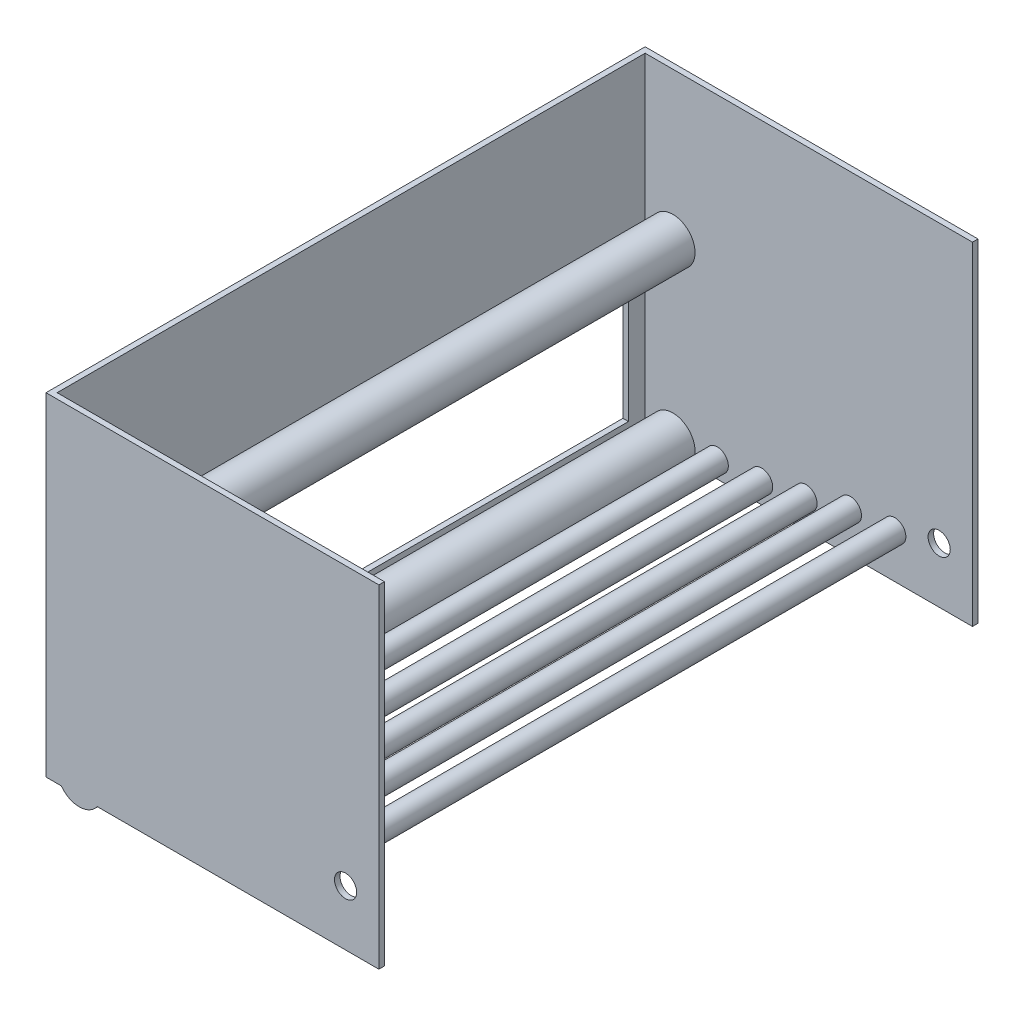
ISO-10303-21;
HEADER;
FILE_DESCRIPTION(('STEP AP214'),'2;1');
FILE_NAME('part.step','',(''),(''),'','','');
FILE_SCHEMA(('AUTOMOTIVE_DESIGN { 1 0 10303 214 1 1 1 1 }'));
ENDSEC;
DATA;
#1=APPLICATION_CONTEXT('core data for automotive mechanical design processes');
#2=APPLICATION_PROTOCOL_DEFINITION('international standard','automotive_design',2000,#1);
#3=PRODUCT_CONTEXT('',#1,'mechanical');
#4=PRODUCT('Part','Part','',(#3));
#5=PRODUCT_RELATED_PRODUCT_CATEGORY('part','',(#4));
#6=PRODUCT_DEFINITION_FORMATION('','',#4);
#7=PRODUCT_DEFINITION_CONTEXT('part definition',#1,'design');
#8=PRODUCT_DEFINITION('design','',#6,#7);
#9=PRODUCT_DEFINITION_SHAPE('','',#8);
#10=(LENGTH_UNIT() NAMED_UNIT(*) SI_UNIT(.MILLI.,.METRE.));
#11=(NAMED_UNIT(*) PLANE_ANGLE_UNIT() SI_UNIT($,.RADIAN.));
#12=(NAMED_UNIT(*) SI_UNIT($,.STERADIAN.) SOLID_ANGLE_UNIT());
#13=UNCERTAINTY_MEASURE_WITH_UNIT(LENGTH_MEASURE(1.E-05),#10,'distance_accuracy_value','');
#14=(GEOMETRIC_REPRESENTATION_CONTEXT(3) GLOBAL_UNCERTAINTY_ASSIGNED_CONTEXT((#13)) GLOBAL_UNIT_ASSIGNED_CONTEXT((#10,
#11,#12)) REPRESENTATION_CONTEXT('',''));
#15=CARTESIAN_POINT('',(0.,0.,0.));
#16=DIRECTION('',(0.,0.,1.));
#17=DIRECTION('',(1.,0.,0.));
#18=AXIS2_PLACEMENT_3D('',#15,#16,#17);
#19=CARTESIAN_POINT('',(0.,0.,0.));
#20=DIRECTION('',(0.,-1.,0.));
#21=DIRECTION('',(0.,0.,-1.));
#22=AXIS2_PLACEMENT_3D('',#19,#20,#21);
#23=PLANE('',#22);
#24=DIRECTION('',(0.,0.,1.));
#25=VECTOR('',#24,1.);
#26=CARTESIAN_POINT('',(58.6724220951825,0.,-751.292048968553));
#27=LINE('',#26,#25);
#28=CARTESIAN_POINT('',(58.6724220951825,0.,-6.34999999999997));
#29=VERTEX_POINT('',#28);
#30=CARTESIAN_POINT('',(58.6724220951825,0.,0.));
#31=VERTEX_POINT('',#30);
#32=EDGE_CURVE('E220',#29,#31,#27,.T.);
#33=ORIENTED_EDGE('',*,*,#32,.F.);
#34=DIRECTION('',(1.,0.,0.));
#35=VECTOR('',#34,1.);
#36=CARTESIAN_POINT('',(0.,0.,-6.35));
#37=LINE('',#36,#35);
#38=CARTESIAN_POINT('',(381.,0.,-6.35));
#39=VERTEX_POINT('',#38);
#40=EDGE_CURVE('E279',#29,#39,#37,.T.);
#41=ORIENTED_EDGE('',*,*,#40,.T.);
#42=DIRECTION('',(0.,0.,-1.));
#43=VECTOR('',#42,1.);
#44=CARTESIAN_POINT('',(381.,0.,0.));
#45=LINE('',#44,#43);
#46=CARTESIAN_POINT('',(381.,0.,0.));
#47=VERTEX_POINT('',#46);
#48=EDGE_CURVE('E330',#47,#39,#45,.T.);
#49=ORIENTED_EDGE('',*,*,#48,.F.);
#50=DIRECTION('',(1.,0.,0.));
#51=VECTOR('',#50,1.);
#52=CARTESIAN_POINT('',(0.,0.,0.));
#53=LINE('',#52,#51);
#54=EDGE_CURVE('E324',#31,#47,#53,.T.);
#55=ORIENTED_EDGE('',*,*,#54,.F.);
#56=EDGE_LOOP('',(#33,#41,#49,#55));
#57=FACE_BOUND('',#56,.T.);
#58=ADVANCED_FACE('F49',(#57),#23,.T.);
#59=CARTESIAN_POINT('',(381.,381.,0.));
#60=DIRECTION('',(-1.,0.,0.));
#61=DIRECTION('',(0.,0.,1.));
#62=AXIS2_PLACEMENT_3D('',#59,#60,#61);
#63=PLANE('',#62);
#64=DIRECTION('',(0.,-1.,0.));
#65=VECTOR('',#64,1.);
#66=CARTESIAN_POINT('',(381.,381.,-6.35));
#67=LINE('',#66,#65);
#68=CARTESIAN_POINT('',(381.,381.,-6.35));
#69=VERTEX_POINT('',#68);
#70=EDGE_CURVE('E269',#69,#39,#67,.T.);
#71=ORIENTED_EDGE('',*,*,#70,.F.);
#72=DIRECTION('',(0.,0.,-1.));
#73=VECTOR('',#72,1.);
#74=CARTESIAN_POINT('',(381.,381.,0.));
#75=LINE('',#74,#73);
#76=CARTESIAN_POINT('',(381.,381.,0.));
#77=VERTEX_POINT('',#76);
#78=EDGE_CURVE('E313',#77,#69,#75,.T.);
#79=ORIENTED_EDGE('',*,*,#78,.F.);
#80=DIRECTION('',(0.,-1.,0.));
#81=VECTOR('',#80,1.);
#82=CARTESIAN_POINT('',(381.,381.,0.));
#83=LINE('',#82,#81);
#84=EDGE_CURVE('E343',#77,#47,#83,.T.);
#85=ORIENTED_EDGE('',*,*,#84,.T.);
#86=ORIENTED_EDGE('',*,*,#48,.T.);
#87=EDGE_LOOP('',(#71,#79,#85,#86));
#88=FACE_BOUND('',#87,.T.);
#89=ADVANCED_FACE('F446',(#88),#63,.F.);
#90=CARTESIAN_POINT('',(0.,381.,0.));
#91=DIRECTION('',(0.,-1.,0.));
#92=DIRECTION('',(0.,0.,-1.));
#93=AXIS2_PLACEMENT_3D('',#90,#91,#92);
#94=PLANE('',#93);
#95=DIRECTION('',(1.,0.,0.));
#96=VECTOR('',#95,1.);
#97=CARTESIAN_POINT('',(0.,381.,-6.35));
#98=LINE('',#97,#96);
#99=CARTESIAN_POINT('',(6.35,381.,-6.35));
#100=VERTEX_POINT('',#99);
#101=EDGE_CURVE('E292',#100,#69,#98,.T.);
#102=ORIENTED_EDGE('',*,*,#101,.F.);
#103=DIRECTION('',(0.,0.,1.));
#104=VECTOR('',#103,1.);
#105=CARTESIAN_POINT('',(6.35,381.,0.));
#106=LINE('',#105,#104);
#107=CARTESIAN_POINT('',(6.35,381.,-679.45));
#108=VERTEX_POINT('',#107);
#109=EDGE_CURVE('E284',#108,#100,#106,.T.);
#110=ORIENTED_EDGE('',*,*,#109,.F.);
#111=DIRECTION('',(-1.,0.,0.));
#112=VECTOR('',#111,1.);
#113=CARTESIAN_POINT('',(0.,381.,-679.45));
#114=LINE('',#113,#112);
#115=CARTESIAN_POINT('',(381.,381.,-679.45));
#116=VERTEX_POINT('',#115);
#117=EDGE_CURVE('E275',#116,#108,#114,.T.);
#118=ORIENTED_EDGE('',*,*,#117,.F.);
#119=CARTESIAN_POINT('',(381.,381.,-685.8));
#120=VERTEX_POINT('',#119);
#121=EDGE_CURVE('E312',#116,#120,#75,.T.);
#122=ORIENTED_EDGE('',*,*,#121,.T.);
#123=DIRECTION('',(-1.,0.,0.));
#124=VECTOR('',#123,1.);
#125=CARTESIAN_POINT('',(0.,381.,-685.8));
#126=LINE('',#125,#124);
#127=CARTESIAN_POINT('',(0.,381.,-685.8));
#128=VERTEX_POINT('',#127);
#129=EDGE_CURVE('E317',#120,#128,#126,.T.);
#130=ORIENTED_EDGE('',*,*,#129,.T.);
#131=DIRECTION('',(0.,0.,1.));
#132=VECTOR('',#131,1.);
#133=CARTESIAN_POINT('',(0.,381.,0.));
#134=LINE('',#133,#132);
#135=CARTESIAN_POINT('',(0.,381.,0.));
#136=VERTEX_POINT('',#135);
#137=EDGE_CURVE('E304',#128,#136,#134,.T.);
#138=ORIENTED_EDGE('',*,*,#137,.T.);
#139=DIRECTION('',(1.,0.,0.));
#140=VECTOR('',#139,1.);
#141=CARTESIAN_POINT('',(0.,381.,0.));
#142=LINE('',#141,#140);
#143=EDGE_CURVE('E308',#136,#77,#142,.T.);
#144=ORIENTED_EDGE('',*,*,#143,.T.);
#145=ORIENTED_EDGE('',*,*,#78,.T.);
#146=EDGE_LOOP('',(#102,#110,#118,#122,#130,#138,#144,#145));
#147=FACE_BOUND('',#146,.T.);
#148=ADVANCED_FACE('F427',(#147),#94,.F.);
#149=DIRECTION('',(0.,0.,1.));
#150=VECTOR('',#149,1.);
#151=CARTESIAN_POINT('',(17.5275779048174,0.,-751.292048968553));
#152=LINE('',#151,#150);
#153=CARTESIAN_POINT('',(17.5275779048173,0.,0.));
#154=VERTEX_POINT('',#153);
#155=CARTESIAN_POINT('',(17.5275779048173,0.,-6.34999999999997));
#156=VERTEX_POINT('',#155);
#157=EDGE_CURVE('E216',#154,#156,#152,.F.);
#158=ORIENTED_EDGE('',*,*,#157,.F.);
#159=CARTESIAN_POINT('',(0.,0.,0.));
#160=VERTEX_POINT('',#159);
#161=EDGE_CURVE('E325',#160,#154,#53,.T.);
#162=ORIENTED_EDGE('',*,*,#161,.F.);
#163=DIRECTION('',(0.,0.,1.));
#164=VECTOR('',#163,1.);
#165=CARTESIAN_POINT('',(0.,0.,0.));
#166=LINE('',#165,#164);
#167=CARTESIAN_POINT('',(0.,0.,-685.8));
#168=VERTEX_POINT('',#167);
#169=EDGE_CURVE('E268',#168,#160,#166,.T.);
#170=ORIENTED_EDGE('',*,*,#169,.F.);
#171=DIRECTION('',(-1.,0.,0.));
#172=VECTOR('',#171,1.);
#173=CARTESIAN_POINT('',(0.,0.,-685.8));
#174=LINE('',#173,#172);
#175=CARTESIAN_POINT('',(381.,0.,-685.8));
#176=VERTEX_POINT('',#175);
#177=EDGE_CURVE('E309',#176,#168,#174,.T.);
#178=ORIENTED_EDGE('',*,*,#177,.F.);
#179=CARTESIAN_POINT('',(381.,0.,-679.45));
#180=VERTEX_POINT('',#179);
#181=EDGE_CURVE('E329',#180,#176,#45,.T.);
#182=ORIENTED_EDGE('',*,*,#181,.F.);
#183=DIRECTION('',(-1.,0.,0.));
#184=VECTOR('',#183,1.);
#185=CARTESIAN_POINT('',(0.,0.,-679.45));
#186=LINE('',#185,#184);
#187=CARTESIAN_POINT('',(58.6724220951825,0.,-679.45));
#188=VERTEX_POINT('',#187);
#189=EDGE_CURVE('E280',#180,#188,#186,.T.);
#190=ORIENTED_EDGE('',*,*,#189,.T.);
#191=CARTESIAN_POINT('',(17.5275779048173,0.,-679.45));
#192=VERTEX_POINT('',#191);
#193=EDGE_CURVE('E285',#188,#192,#186,.T.);
#194=ORIENTED_EDGE('',*,*,#193,.T.);
#195=CARTESIAN_POINT('',(6.35,0.,-679.45));
#196=VERTEX_POINT('',#195);
#197=EDGE_CURVE('E286',#192,#196,#186,.T.);
#198=ORIENTED_EDGE('',*,*,#197,.T.);
#199=DIRECTION('',(0.,0.,1.));
#200=VECTOR('',#199,1.);
#201=CARTESIAN_POINT('',(6.35,0.,0.));
#202=LINE('',#201,#200);
#203=CARTESIAN_POINT('',(6.35,0.,-6.35));
#204=VERTEX_POINT('',#203);
#205=EDGE_CURVE('E263',#196,#204,#202,.T.);
#206=ORIENTED_EDGE('',*,*,#205,.T.);
#207=EDGE_CURVE('E300',#204,#156,#37,.T.);
#208=ORIENTED_EDGE('',*,*,#207,.T.);
#209=EDGE_LOOP('',(#158,#162,#170,#178,#182,#190,#194,#198,#206,#208));
#210=FACE_BOUND('',#209,.T.);
#211=ADVANCED_FACE('F419',(#210),#23,.T.);
#212=CARTESIAN_POINT('',(0.,381.,0.));
#213=DIRECTION('',(1.,0.,0.));
#214=DIRECTION('',(0.,0.,-1.));
#215=AXIS2_PLACEMENT_3D('',#212,#213,#214);
#216=PLANE('',#215);
#217=DIRECTION('',(0.,0.,-1.));
#218=VECTOR('',#217,1.);
#219=CARTESIAN_POINT('',(0.,190.5,-25.4));
#220=LINE('',#219,#218);
#221=CARTESIAN_POINT('',(0.,190.5,-25.4));
#222=VERTEX_POINT('',#221);
#223=CARTESIAN_POINT('',(0.,190.5,-660.4));
#224=VERTEX_POINT('',#223);
#225=EDGE_CURVE('E179',#222,#224,#220,.T.);
#226=ORIENTED_EDGE('',*,*,#225,.F.);
#227=DIRECTION('',(0.,1.,0.));
#228=VECTOR('',#227,1.);
#229=CARTESIAN_POINT('',(0.,190.5,-25.4));
#230=LINE('',#229,#228);
#231=CARTESIAN_POINT('',(0.,25.4,-25.4));
#232=VERTEX_POINT('',#231);
#233=EDGE_CURVE('E160',#232,#222,#230,.T.);
#234=ORIENTED_EDGE('',*,*,#233,.F.);
#235=DIRECTION('',(0.,0.,1.));
#236=VECTOR('',#235,1.);
#237=CARTESIAN_POINT('',(0.,25.4,-25.4));
#238=LINE('',#237,#236);
#239=CARTESIAN_POINT('',(0.,25.4,-660.4));
#240=VERTEX_POINT('',#239);
#241=EDGE_CURVE('E170',#240,#232,#238,.T.);
#242=ORIENTED_EDGE('',*,*,#241,.F.);
#243=DIRECTION('',(0.,-1.,0.));
#244=VECTOR('',#243,1.);
#245=CARTESIAN_POINT('',(0.,190.5,-660.4));
#246=LINE('',#245,#244);
#247=EDGE_CURVE('E66',#224,#240,#246,.T.);
#248=ORIENTED_EDGE('',*,*,#247,.F.);
#249=EDGE_LOOP('',(#226,#234,#242,#248));
#250=FACE_BOUND('',#249,.T.);
#251=ORIENTED_EDGE('',*,*,#169,.T.);
#252=DIRECTION('',(0.,-1.,0.));
#253=VECTOR('',#252,1.);
#254=CARTESIAN_POINT('',(0.,381.,0.));
#255=LINE('',#254,#253);
#256=EDGE_CURVE('E347',#136,#160,#255,.T.);
#257=ORIENTED_EDGE('',*,*,#256,.F.);
#258=ORIENTED_EDGE('',*,*,#137,.F.);
#259=DIRECTION('',(0.,-1.,0.));
#260=VECTOR('',#259,1.);
#261=CARTESIAN_POINT('',(0.,381.,-685.8));
#262=LINE('',#261,#260);
#263=EDGE_CURVE('E320',#128,#168,#262,.T.);
#264=ORIENTED_EDGE('',*,*,#263,.T.);
#265=EDGE_LOOP('',(#251,#257,#258,#264));
#266=FACE_BOUND('',#265,.T.);
#267=ADVANCED_FACE('F51',(#250,#266),#216,.F.);
#268=CARTESIAN_POINT('',(0.,381.,0.));
#269=DIRECTION('',(0.,0.,-1.));
#270=DIRECTION('',(-1.,0.,0.));
#271=AXIS2_PLACEMENT_3D('',#268,#269,#270);
#272=PLANE('',#271);
#273=CARTESIAN_POINT('',(342.9,63.5,0.));
#274=DIRECTION('',(0.,0.,-1.));
#275=DIRECTION('',(-1.,0.,0.));
#276=AXIS2_PLACEMENT_3D('',#273,#274,#275);
#277=CIRCLE('',#276,12.7);
#278=CARTESIAN_POINT('',(330.2,63.5,0.));
#279=VERTEX_POINT('',#278);
#280=EDGE_CURVE('E259',#279,#279,#277,.T.);
#281=ORIENTED_EDGE('',*,*,#280,.T.);
#282=EDGE_LOOP('',(#281));
#283=FACE_BOUND('',#282,.T.);
#284=ORIENTED_EDGE('',*,*,#161,.T.);
#285=CARTESIAN_POINT('',(38.0999999999999,14.8974980831562,0.));
#286=DIRECTION('',(0.,0.,1.));
#287=DIRECTION('',(1.,0.,0.));
#288=AXIS2_PLACEMENT_3D('',#285,#286,#287);
#289=CIRCLE('',#288,25.4);
#290=EDGE_CURVE('E174',#154,#31,#289,.T.);
#291=ORIENTED_EDGE('',*,*,#290,.T.);
#292=ORIENTED_EDGE('',*,*,#54,.T.);
#293=ORIENTED_EDGE('',*,*,#84,.F.);
#294=ORIENTED_EDGE('',*,*,#143,.F.);
#295=ORIENTED_EDGE('',*,*,#256,.T.);
#296=EDGE_LOOP('',(#284,#291,#292,#293,#294,#295));
#297=FACE_BOUND('',#296,.T.);
#298=ADVANCED_FACE('F422',(#283,#297),#272,.F.);
#299=ORIENTED_EDGE('',*,*,#121,.F.);
#300=DIRECTION('',(0.,-1.,0.));
#301=VECTOR('',#300,1.);
#302=CARTESIAN_POINT('',(381.,381.,-679.45));
#303=LINE('',#302,#301);
#304=EDGE_CURVE('E274',#116,#180,#303,.T.);
#305=ORIENTED_EDGE('',*,*,#304,.T.);
#306=ORIENTED_EDGE('',*,*,#181,.T.);
#307=DIRECTION('',(0.,-1.,0.));
#308=VECTOR('',#307,1.);
#309=CARTESIAN_POINT('',(381.,381.,-685.8));
#310=LINE('',#309,#308);
#311=EDGE_CURVE('E339',#120,#176,#310,.T.);
#312=ORIENTED_EDGE('',*,*,#311,.F.);
#313=EDGE_LOOP('',(#299,#305,#306,#312));
#314=FACE_BOUND('',#313,.T.);
#315=ADVANCED_FACE('F408',(#314),#63,.F.);
#316=CARTESIAN_POINT('',(0.,381.,-685.8));
#317=DIRECTION('',(0.,0.,1.));
#318=DIRECTION('',(1.,0.,0.));
#319=AXIS2_PLACEMENT_3D('',#316,#317,#318);
#320=PLANE('',#319);
#321=CARTESIAN_POINT('',(342.9,63.5,-685.8));
#322=DIRECTION('',(0.,0.,1.));
#323=DIRECTION('',(1.,0.,0.));
#324=AXIS2_PLACEMENT_3D('',#321,#322,#323);
#325=CIRCLE('',#324,12.7);
#326=CARTESIAN_POINT('',(355.6,63.5,-685.8));
#327=VERTEX_POINT('',#326);
#328=EDGE_CURVE('E224',#327,#327,#325,.T.);
#329=ORIENTED_EDGE('',*,*,#328,.T.);
#330=EDGE_LOOP('',(#329));
#331=FACE_BOUND('',#330,.T.);
#332=ORIENTED_EDGE('',*,*,#177,.T.);
#333=ORIENTED_EDGE('',*,*,#263,.F.);
#334=ORIENTED_EDGE('',*,*,#129,.F.);
#335=ORIENTED_EDGE('',*,*,#311,.T.);
#336=EDGE_LOOP('',(#332,#333,#334,#335));
#337=FACE_BOUND('',#336,.T.);
#338=ADVANCED_FACE('F404',(#331,#337),#320,.F.);
#339=CARTESIAN_POINT('',(6.35,381.,0.));
#340=DIRECTION('',(1.,0.,0.));
#341=DIRECTION('',(0.,0.,-1.));
#342=AXIS2_PLACEMENT_3D('',#339,#340,#341);
#343=PLANE('',#342);
#344=DIRECTION('',(0.,-1.,0.));
#345=VECTOR('',#344,1.);
#346=CARTESIAN_POINT('',(6.35,190.5,-25.4));
#347=LINE('',#346,#345);
#348=CARTESIAN_POINT('',(6.35,190.5,-25.4));
#349=VERTEX_POINT('',#348);
#350=CARTESIAN_POINT('',(6.35,25.4,-25.4));
#351=VERTEX_POINT('',#350);
#352=EDGE_CURVE('E74',#349,#351,#347,.T.);
#353=ORIENTED_EDGE('',*,*,#352,.F.);
#354=DIRECTION('',(0.,0.,1.));
#355=VECTOR('',#354,1.);
#356=CARTESIAN_POINT('',(6.35,190.5,-25.4));
#357=LINE('',#356,#355);
#358=CARTESIAN_POINT('',(6.35,190.5,-660.4));
#359=VERTEX_POINT('',#358);
#360=EDGE_CURVE('E167',#359,#349,#357,.T.);
#361=ORIENTED_EDGE('',*,*,#360,.F.);
#362=DIRECTION('',(0.,1.,0.));
#363=VECTOR('',#362,1.);
#364=CARTESIAN_POINT('',(6.35,190.5,-660.4));
#365=LINE('',#364,#363);
#366=CARTESIAN_POINT('',(6.35,25.4,-660.4));
#367=VERTEX_POINT('',#366);
#368=EDGE_CURVE('E191',#367,#359,#365,.T.);
#369=ORIENTED_EDGE('',*,*,#368,.F.);
#370=DIRECTION('',(0.,0.,-1.));
#371=VECTOR('',#370,1.);
#372=CARTESIAN_POINT('',(6.35,25.4,-25.4));
#373=LINE('',#372,#371);
#374=EDGE_CURVE('E184',#351,#367,#373,.T.);
#375=ORIENTED_EDGE('',*,*,#374,.F.);
#376=EDGE_LOOP('',(#353,#361,#369,#375));
#377=FACE_BOUND('',#376,.T.);
#378=ORIENTED_EDGE('',*,*,#205,.F.);
#379=DIRECTION('',(0.,-1.,0.));
#380=VECTOR('',#379,1.);
#381=CARTESIAN_POINT('',(6.35,381.,-679.45));
#382=LINE('',#381,#380);
#383=EDGE_CURVE('E270',#108,#196,#382,.T.);
#384=ORIENTED_EDGE('',*,*,#383,.F.);
#385=ORIENTED_EDGE('',*,*,#109,.T.);
#386=DIRECTION('',(0.,-1.,0.));
#387=VECTOR('',#386,1.);
#388=CARTESIAN_POINT('',(6.35,381.,-6.35));
#389=LINE('',#388,#387);
#390=EDGE_CURVE('E264',#100,#204,#389,.T.);
#391=ORIENTED_EDGE('',*,*,#390,.T.);
#392=EDGE_LOOP('',(#378,#384,#385,#391));
#393=FACE_BOUND('',#392,.T.);
#394=ADVANCED_FACE('F407',(#377,#393),#343,.T.);
#395=CARTESIAN_POINT('',(0.,381.,-6.35));
#396=DIRECTION('',(0.,0.,-1.));
#397=DIRECTION('',(-1.,0.,0.));
#398=AXIS2_PLACEMENT_3D('',#395,#396,#397);
#399=PLANE('',#398);
#400=CARTESIAN_POINT('',(38.0999999999999,211.747498083156,-6.34999999999997));
#401=DIRECTION('',(0.,0.,-1.));
#402=DIRECTION('',(-1.,0.,0.));
#403=AXIS2_PLACEMENT_3D('',#400,#401,#402);
#404=CIRCLE('',#403,25.4);
#405=CARTESIAN_POINT('',(12.6999999999999,211.747498083156,-6.34999999999997));
#406=VERTEX_POINT('',#405);
#407=EDGE_CURVE('E11',#406,#406,#404,.T.);
#408=ORIENTED_EDGE('',*,*,#407,.F.);
#409=EDGE_LOOP('',(#408));
#410=FACE_BOUND('',#409,.T.);
#411=CARTESIAN_POINT('',(38.0999999999999,14.8974980831562,-6.34999999999997));
#412=DIRECTION('',(0.,0.,-1.));
#413=DIRECTION('',(-1.,0.,0.));
#414=AXIS2_PLACEMENT_3D('',#411,#412,#413);
#415=CIRCLE('',#414,25.4);
#416=EDGE_CURVE('E212',#156,#29,#415,.T.);
#417=ORIENTED_EDGE('',*,*,#416,.F.);
#418=ORIENTED_EDGE('',*,*,#207,.F.);
#419=ORIENTED_EDGE('',*,*,#390,.F.);
#420=ORIENTED_EDGE('',*,*,#101,.T.);
#421=ORIENTED_EDGE('',*,*,#70,.T.);
#422=ORIENTED_EDGE('',*,*,#40,.F.);
#423=EDGE_LOOP('',(#417,#418,#419,#420,#421,#422));
#424=FACE_BOUND('',#423,.T.);
#425=CARTESIAN_POINT('',(139.7,23.7863462973908,-6.34999999999997));
#426=DIRECTION('',(0.,0.,-1.));
#427=DIRECTION('',(-1.,0.,0.));
#428=AXIS2_PLACEMENT_3D('',#425,#426,#427);
#429=CIRCLE('',#428,12.7);
#430=CARTESIAN_POINT('',(127.,23.7863462973908,-6.34999999999997));
#431=VERTEX_POINT('',#430);
#432=EDGE_CURVE('E225',#431,#431,#429,.T.);
#433=ORIENTED_EDGE('',*,*,#432,.F.);
#434=EDGE_LOOP('',(#433));
#435=FACE_BOUND('',#434,.T.);
#436=CARTESIAN_POINT('',(241.3,46.3555758928827,-6.34999999999997));
#437=DIRECTION('',(0.,0.,-1.));
#438=DIRECTION('',(-1.,0.,0.));
#439=AXIS2_PLACEMENT_3D('',#436,#437,#438);
#440=CIRCLE('',#439,12.7);
#441=CARTESIAN_POINT('',(228.6,46.3555758928827,-6.34999999999997));
#442=VERTEX_POINT('',#441);
#443=EDGE_CURVE('E231',#442,#442,#440,.T.);
#444=ORIENTED_EDGE('',*,*,#443,.F.);
#445=EDGE_LOOP('',(#444));
#446=FACE_BOUND('',#445,.T.);
#447=CARTESIAN_POINT('',(88.8999999999999,19.3419221902735,-6.34999999999997));
#448=DIRECTION('',(0.,0.,-1.));
#449=DIRECTION('',(-1.,0.,0.));
#450=AXIS2_PLACEMENT_3D('',#447,#448,#449);
#451=CIRCLE('',#450,12.7);
#452=CARTESIAN_POINT('',(76.1999999999999,19.3419221902735,-6.34999999999997));
#453=VERTEX_POINT('',#452);
#454=EDGE_CURVE('E236',#453,#453,#451,.T.);
#455=ORIENTED_EDGE('',*,*,#454,.F.);
#456=EDGE_LOOP('',(#455));
#457=FACE_BOUND('',#456,.T.);
#458=CARTESIAN_POINT('',(190.5,32.7437569173812,-6.34999999999997));
#459=DIRECTION('',(0.,0.,-1.));
#460=DIRECTION('',(-1.,0.,0.));
#461=AXIS2_PLACEMENT_3D('',#458,#459,#460);
#462=CIRCLE('',#461,12.7);
#463=CARTESIAN_POINT('',(177.8,32.7437569173812,-6.34999999999997));
#464=VERTEX_POINT('',#463);
#465=EDGE_CURVE('E241',#464,#464,#462,.T.);
#466=ORIENTED_EDGE('',*,*,#465,.F.);
#467=EDGE_LOOP('',(#466));
#468=FACE_BOUND('',#467,.T.);
#469=CARTESIAN_POINT('',(292.1,50.8,-6.34999999999997));
#470=DIRECTION('',(0.,0.,-1.));
#471=DIRECTION('',(-1.,0.,0.));
#472=AXIS2_PLACEMENT_3D('',#469,#470,#471);
#473=CIRCLE('',#472,12.7);
#474=CARTESIAN_POINT('',(279.4,50.8,-6.34999999999997));
#475=VERTEX_POINT('',#474);
#476=EDGE_CURVE('E246',#475,#475,#473,.T.);
#477=ORIENTED_EDGE('',*,*,#476,.F.);
#478=EDGE_LOOP('',(#477));
#479=FACE_BOUND('',#478,.T.);
#480=CARTESIAN_POINT('',(342.9,63.5,-6.34999999999997));
#481=DIRECTION('',(0.,0.,-1.));
#482=DIRECTION('',(-1.,0.,0.));
#483=AXIS2_PLACEMENT_3D('',#480,#481,#482);
#484=CIRCLE('',#483,12.7);
#485=CARTESIAN_POINT('',(330.2,63.5,-6.34999999999997));
#486=VERTEX_POINT('',#485);
#487=EDGE_CURVE('E255',#486,#486,#484,.T.);
#488=ORIENTED_EDGE('',*,*,#487,.F.);
#489=EDGE_LOOP('',(#488));
#490=FACE_BOUND('',#489,.T.);
#491=ADVANCED_FACE('F382',(#410,#424,#435,#446,#457,#468,#479,#490),#399,.T.);
#492=CARTESIAN_POINT('',(0.,381.,-679.45));
#493=DIRECTION('',(0.,0.,1.));
#494=DIRECTION('',(1.,0.,0.));
#495=AXIS2_PLACEMENT_3D('',#492,#493,#494);
#496=PLANE('',#495);
#497=CARTESIAN_POINT('',(38.0999999999999,211.747498083156,-679.45));
#498=DIRECTION('',(0.,0.,1.));
#499=DIRECTION('',(1.,0.,0.));
#500=AXIS2_PLACEMENT_3D('',#497,#498,#499);
#501=CIRCLE('',#500,25.4);
#502=CARTESIAN_POINT('',(63.4999999999999,211.747498083156,-679.45));
#503=VERTEX_POINT('',#502);
#504=EDGE_CURVE('E53',#503,#503,#501,.T.);
#505=ORIENTED_EDGE('',*,*,#504,.F.);
#506=EDGE_LOOP('',(#505));
#507=FACE_BOUND('',#506,.T.);
#508=CARTESIAN_POINT('',(38.0999999999999,14.8974980831562,-679.45));
#509=DIRECTION('',(0.,0.,1.));
#510=DIRECTION('',(1.,0.,0.));
#511=AXIS2_PLACEMENT_3D('',#508,#509,#510);
#512=CIRCLE('',#511,25.4);
#513=EDGE_CURVE('E229',#188,#192,#512,.T.);
#514=ORIENTED_EDGE('',*,*,#513,.F.);
#515=ORIENTED_EDGE('',*,*,#189,.F.);
#516=ORIENTED_EDGE('',*,*,#304,.F.);
#517=ORIENTED_EDGE('',*,*,#117,.T.);
#518=ORIENTED_EDGE('',*,*,#383,.T.);
#519=ORIENTED_EDGE('',*,*,#197,.F.);
#520=EDGE_LOOP('',(#514,#515,#516,#517,#518,#519));
#521=FACE_BOUND('',#520,.T.);
#522=CARTESIAN_POINT('',(139.7,23.7863462973908,-679.45));
#523=DIRECTION('',(0.,0.,1.));
#524=DIRECTION('',(1.,0.,0.));
#525=AXIS2_PLACEMENT_3D('',#522,#523,#524);
#526=CIRCLE('',#525,12.7);
#527=CARTESIAN_POINT('',(152.4,23.7863462973908,-679.45));
#528=VERTEX_POINT('',#527);
#529=EDGE_CURVE('E230',#528,#528,#526,.T.);
#530=ORIENTED_EDGE('',*,*,#529,.F.);
#531=EDGE_LOOP('',(#530));
#532=FACE_BOUND('',#531,.T.);
#533=CARTESIAN_POINT('',(241.3,46.3555758928827,-679.45));
#534=DIRECTION('',(0.,0.,1.));
#535=DIRECTION('',(1.,0.,0.));
#536=AXIS2_PLACEMENT_3D('',#533,#534,#535);
#537=CIRCLE('',#536,12.7);
#538=CARTESIAN_POINT('',(254.,46.3555758928827,-679.45));
#539=VERTEX_POINT('',#538);
#540=EDGE_CURVE('E235',#539,#539,#537,.T.);
#541=ORIENTED_EDGE('',*,*,#540,.F.);
#542=EDGE_LOOP('',(#541));
#543=FACE_BOUND('',#542,.T.);
#544=CARTESIAN_POINT('',(88.8999999999999,19.3419221902735,-679.45));
#545=DIRECTION('',(0.,0.,1.));
#546=DIRECTION('',(1.,0.,0.));
#547=AXIS2_PLACEMENT_3D('',#544,#545,#546);
#548=CIRCLE('',#547,12.7);
#549=CARTESIAN_POINT('',(101.6,19.3419221902735,-679.45));
#550=VERTEX_POINT('',#549);
#551=EDGE_CURVE('E240',#550,#550,#548,.T.);
#552=ORIENTED_EDGE('',*,*,#551,.F.);
#553=EDGE_LOOP('',(#552));
#554=FACE_BOUND('',#553,.T.);
#555=CARTESIAN_POINT('',(190.5,32.7437569173812,-679.45));
#556=DIRECTION('',(0.,0.,1.));
#557=DIRECTION('',(1.,0.,0.));
#558=AXIS2_PLACEMENT_3D('',#555,#556,#557);
#559=CIRCLE('',#558,12.7);
#560=CARTESIAN_POINT('',(203.2,32.7437569173812,-679.45));
#561=VERTEX_POINT('',#560);
#562=EDGE_CURVE('E245',#561,#561,#559,.T.);
#563=ORIENTED_EDGE('',*,*,#562,.F.);
#564=EDGE_LOOP('',(#563));
#565=FACE_BOUND('',#564,.T.);
#566=CARTESIAN_POINT('',(292.1,50.8,-679.45));
#567=DIRECTION('',(0.,0.,1.));
#568=DIRECTION('',(1.,0.,0.));
#569=AXIS2_PLACEMENT_3D('',#566,#567,#568);
#570=CIRCLE('',#569,12.7);
#571=CARTESIAN_POINT('',(304.8,50.8,-679.45));
#572=VERTEX_POINT('',#571);
#573=EDGE_CURVE('E250',#572,#572,#570,.T.);
#574=ORIENTED_EDGE('',*,*,#573,.F.);
#575=EDGE_LOOP('',(#574));
#576=FACE_BOUND('',#575,.T.);
#577=CARTESIAN_POINT('',(342.9,63.5,-679.45));
#578=DIRECTION('',(0.,0.,1.));
#579=DIRECTION('',(1.,0.,0.));
#580=AXIS2_PLACEMENT_3D('',#577,#578,#579);
#581=CIRCLE('',#580,12.7);
#582=CARTESIAN_POINT('',(355.6,63.5,-679.45));
#583=VERTEX_POINT('',#582);
#584=EDGE_CURVE('E254',#583,#583,#581,.T.);
#585=ORIENTED_EDGE('',*,*,#584,.F.);
#586=EDGE_LOOP('',(#585));
#587=FACE_BOUND('',#586,.T.);
#588=ADVANCED_FACE('F378',(#507,#521,#532,#543,#554,#565,#576,#587),#496,.T.);
#589=CARTESIAN_POINT('',(342.9,63.5,-685.8));
#590=DIRECTION('',(0.,0.,1.));
#591=DIRECTION('',(1.,0.,0.));
#592=AXIS2_PLACEMENT_3D('',#589,#590,#591);
#593=CYLINDRICAL_SURFACE('',#592,12.7);
#594=ORIENTED_EDGE('',*,*,#584,.T.);
#595=EDGE_LOOP('',(#594));
#596=FACE_BOUND('',#595,.T.);
#597=ORIENTED_EDGE('',*,*,#328,.F.);
#598=EDGE_LOOP('',(#597));
#599=FACE_BOUND('',#598,.T.);
#600=ADVANCED_FACE('F381',(#596,#599),#593,.F.);
#601=ORIENTED_EDGE('',*,*,#487,.T.);
#602=EDGE_LOOP('',(#601));
#603=FACE_BOUND('',#602,.T.);
#604=ORIENTED_EDGE('',*,*,#280,.F.);
#605=EDGE_LOOP('',(#604));
#606=FACE_BOUND('',#605,.T.);
#607=ADVANCED_FACE('F400',(#603,#606),#593,.F.);
#608=CARTESIAN_POINT('',(292.1,50.8,-715.371024484277));
#609=DIRECTION('',(0.,0.,1.));
#610=DIRECTION('',(1.,0.,0.));
#611=AXIS2_PLACEMENT_3D('',#608,#609,#610);
#612=CYLINDRICAL_SURFACE('',#611,12.7);
#613=ORIENTED_EDGE('',*,*,#476,.T.);
#614=EDGE_LOOP('',(#613));
#615=FACE_BOUND('',#614,.T.);
#616=ORIENTED_EDGE('',*,*,#573,.T.);
#617=EDGE_LOOP('',(#616));
#618=FACE_BOUND('',#617,.T.);
#619=ADVANCED_FACE('F489',(#615,#618),#612,.T.);
#620=CARTESIAN_POINT('',(190.5,32.7437569173812,-715.371024484277));
#621=DIRECTION('',(0.,0.,1.));
#622=DIRECTION('',(1.,0.,0.));
#623=AXIS2_PLACEMENT_3D('',#620,#621,#622);
#624=CYLINDRICAL_SURFACE('',#623,12.7);
#625=ORIENTED_EDGE('',*,*,#465,.T.);
#626=EDGE_LOOP('',(#625));
#627=FACE_BOUND('',#626,.T.);
#628=ORIENTED_EDGE('',*,*,#562,.T.);
#629=EDGE_LOOP('',(#628));
#630=FACE_BOUND('',#629,.T.);
#631=ADVANCED_FACE('F492',(#627,#630),#624,.T.);
#632=CARTESIAN_POINT('',(88.8999999999999,19.3419221902735,-715.371024484277));
#633=DIRECTION('',(0.,0.,1.));
#634=DIRECTION('',(1.,0.,0.));
#635=AXIS2_PLACEMENT_3D('',#632,#633,#634);
#636=CYLINDRICAL_SURFACE('',#635,12.7);
#637=ORIENTED_EDGE('',*,*,#454,.T.);
#638=EDGE_LOOP('',(#637));
#639=FACE_BOUND('',#638,.T.);
#640=ORIENTED_EDGE('',*,*,#551,.T.);
#641=EDGE_LOOP('',(#640));
#642=FACE_BOUND('',#641,.T.);
#643=ADVANCED_FACE('F496',(#639,#642),#636,.T.);
#644=CARTESIAN_POINT('',(241.3,46.3555758928827,-715.371024484277));
#645=DIRECTION('',(0.,0.,1.));
#646=DIRECTION('',(1.,0.,0.));
#647=AXIS2_PLACEMENT_3D('',#644,#645,#646);
#648=CYLINDRICAL_SURFACE('',#647,12.7);
#649=ORIENTED_EDGE('',*,*,#443,.T.);
#650=EDGE_LOOP('',(#649));
#651=FACE_BOUND('',#650,.T.);
#652=ORIENTED_EDGE('',*,*,#540,.T.);
#653=EDGE_LOOP('',(#652));
#654=FACE_BOUND('',#653,.T.);
#655=ADVANCED_FACE('F462',(#651,#654),#648,.T.);
#656=CARTESIAN_POINT('',(139.7,23.7863462973908,-715.371024484277));
#657=DIRECTION('',(0.,0.,1.));
#658=DIRECTION('',(1.,0.,0.));
#659=AXIS2_PLACEMENT_3D('',#656,#657,#658);
#660=CYLINDRICAL_SURFACE('',#659,12.7);
#661=ORIENTED_EDGE('',*,*,#432,.T.);
#662=EDGE_LOOP('',(#661));
#663=FACE_BOUND('',#662,.T.);
#664=ORIENTED_EDGE('',*,*,#529,.T.);
#665=EDGE_LOOP('',(#664));
#666=FACE_BOUND('',#665,.T.);
#667=ADVANCED_FACE('F454',(#663,#666),#660,.T.);
#668=CARTESIAN_POINT('',(38.0999999999999,14.8974980831562,-751.292048968553));
#669=DIRECTION('',(0.,0.,1.));
#670=DIRECTION('',(1.,0.,0.));
#671=AXIS2_PLACEMENT_3D('',#668,#669,#670);
#672=CYLINDRICAL_SURFACE('',#671,25.4);
#673=CARTESIAN_POINT('',(38.0999999999999,14.8974980831562,-679.45));
#674=DIRECTION('',(0.,0.,1.));
#675=DIRECTION('',(1.,0.,0.));
#676=AXIS2_PLACEMENT_3D('',#673,#674,#675);
#677=CIRCLE('',#676,25.4);
#678=EDGE_CURVE('E208',#188,#192,#677,.F.);
#679=ORIENTED_EDGE('',*,*,#678,.F.);
#680=ORIENTED_EDGE('',*,*,#513,.T.);
#681=EDGE_LOOP('',(#679,#680));
#682=FACE_BOUND('',#681,.T.);
#683=ORIENTED_EDGE('',*,*,#416,.T.);
#684=ORIENTED_EDGE('',*,*,#32,.T.);
#685=ORIENTED_EDGE('',*,*,#290,.F.);
#686=ORIENTED_EDGE('',*,*,#157,.T.);
#687=EDGE_LOOP('',(#683,#684,#685,#686));
#688=FACE_BOUND('',#687,.T.);
#689=ADVANCED_FACE('F451',(#682,#688),#672,.T.);
#690=CARTESIAN_POINT('',(0.,381.,-679.45));
#691=DIRECTION('',(0.,0.,1.));
#692=DIRECTION('',(1.,0.,0.));
#693=AXIS2_PLACEMENT_3D('',#690,#691,#692);
#694=PLANE('',#693);
#695=ORIENTED_EDGE('',*,*,#193,.F.);
#696=ORIENTED_EDGE('',*,*,#678,.T.);
#697=EDGE_LOOP('',(#695,#696));
#698=FACE_BOUND('',#697,.T.);
#699=ADVANCED_FACE('F453',(#698),#694,.F.);
#700=CARTESIAN_POINT('',(38.0999999999999,211.747498083156,-751.292048968553));
#701=DIRECTION('',(0.,0.,1.));
#702=DIRECTION('',(1.,0.,0.));
#703=AXIS2_PLACEMENT_3D('',#700,#701,#702);
#704=CYLINDRICAL_SURFACE('',#703,25.4);
#705=ORIENTED_EDGE('',*,*,#407,.T.);
#706=EDGE_LOOP('',(#705));
#707=FACE_BOUND('',#706,.T.);
#708=ORIENTED_EDGE('',*,*,#504,.T.);
#709=EDGE_LOOP('',(#708));
#710=FACE_BOUND('',#709,.T.);
#711=ADVANCED_FACE('F376',(#707,#710),#704,.T.);
#712=CARTESIAN_POINT('',(-0.00100000000000013,190.5,-25.4));
#713=DIRECTION('',(0.,0.,1.));
#714=DIRECTION('',(0.,-1.,0.));
#715=AXIS2_PLACEMENT_3D('',#712,#713,#714);
#716=PLANE('',#715);
#717=ORIENTED_EDGE('',*,*,#233,.T.);
#718=DIRECTION('',(1.,0.,0.));
#719=VECTOR('',#718,1.);
#720=CARTESIAN_POINT('',(-0.00100000000000013,190.5,-25.4));
#721=LINE('',#720,#719);
#722=EDGE_CURVE('E175',#222,#349,#721,.T.);
#723=ORIENTED_EDGE('',*,*,#722,.T.);
#724=ORIENTED_EDGE('',*,*,#352,.T.);
#725=DIRECTION('',(1.,0.,0.));
#726=VECTOR('',#725,1.);
#727=CARTESIAN_POINT('',(-0.00100000000000013,25.4,-25.4));
#728=LINE('',#727,#726);
#729=EDGE_CURVE('E156',#232,#351,#728,.T.);
#730=ORIENTED_EDGE('',*,*,#729,.F.);
#731=EDGE_LOOP('',(#717,#723,#724,#730));
#732=FACE_BOUND('',#731,.T.);
#733=ADVANCED_FACE('F158',(#732),#716,.F.);
#734=CARTESIAN_POINT('',(-0.00100000000000013,190.5,-25.4));
#735=DIRECTION('',(0.,1.,0.));
#736=DIRECTION('',(0.,0.,1.));
#737=AXIS2_PLACEMENT_3D('',#734,#735,#736);
#738=PLANE('',#737);
#739=ORIENTED_EDGE('',*,*,#225,.T.);
#740=DIRECTION('',(1.,0.,0.));
#741=VECTOR('',#740,1.);
#742=CARTESIAN_POINT('',(-0.00100000000000013,190.5,-660.4));
#743=LINE('',#742,#741);
#744=EDGE_CURVE('E200',#224,#359,#743,.T.);
#745=ORIENTED_EDGE('',*,*,#744,.T.);
#746=ORIENTED_EDGE('',*,*,#360,.T.);
#747=ORIENTED_EDGE('',*,*,#722,.F.);
#748=EDGE_LOOP('',(#739,#745,#746,#747));
#749=FACE_BOUND('',#748,.T.);
#750=ADVANCED_FACE('F623',(#749),#738,.F.);
#751=CARTESIAN_POINT('',(-0.00100000000000013,190.5,-660.4));
#752=DIRECTION('',(0.,0.,-1.));
#753=DIRECTION('',(-1.,0.,0.));
#754=AXIS2_PLACEMENT_3D('',#751,#752,#753);
#755=PLANE('',#754);
#756=ORIENTED_EDGE('',*,*,#247,.T.);
#757=DIRECTION('',(1.,0.,0.));
#758=VECTOR('',#757,1.);
#759=CARTESIAN_POINT('',(-0.00100000000000013,25.4,-660.4));
#760=LINE('',#759,#758);
#761=EDGE_CURVE('E166',#240,#367,#760,.T.);
#762=ORIENTED_EDGE('',*,*,#761,.T.);
#763=ORIENTED_EDGE('',*,*,#368,.T.);
#764=ORIENTED_EDGE('',*,*,#744,.F.);
#765=EDGE_LOOP('',(#756,#762,#763,#764));
#766=FACE_BOUND('',#765,.T.);
#767=ADVANCED_FACE('F631',(#766),#755,.F.);
#768=CARTESIAN_POINT('',(-0.00100000000000013,25.4,-25.4));
#769=DIRECTION('',(0.,-1.,0.));
#770=DIRECTION('',(0.,0.,-1.));
#771=AXIS2_PLACEMENT_3D('',#768,#769,#770);
#772=PLANE('',#771);
#773=ORIENTED_EDGE('',*,*,#241,.T.);
#774=ORIENTED_EDGE('',*,*,#729,.T.);
#775=ORIENTED_EDGE('',*,*,#374,.T.);
#776=ORIENTED_EDGE('',*,*,#761,.F.);
#777=EDGE_LOOP('',(#773,#774,#775,#776));
#778=FACE_BOUND('',#777,.T.);
#779=ADVANCED_FACE('F171',(#778),#772,.F.);
#780=CLOSED_SHELL('',(#58,#89,#148,#211,#267,#298,#315,#338,#394,#491,#588,#600,#607,#619,#631,
#643,#655,#667,#689,#699,#711,#733,#750,#767,#779));
#781=MANIFOLD_SOLID_BREP('B2',#780);
#782=ADVANCED_BREP_SHAPE_REPRESENTATION('',(#18,#781),#14);
#783=SHAPE_DEFINITION_REPRESENTATION(#9,#782);
ENDSEC;
END-ISO-10303-21;
